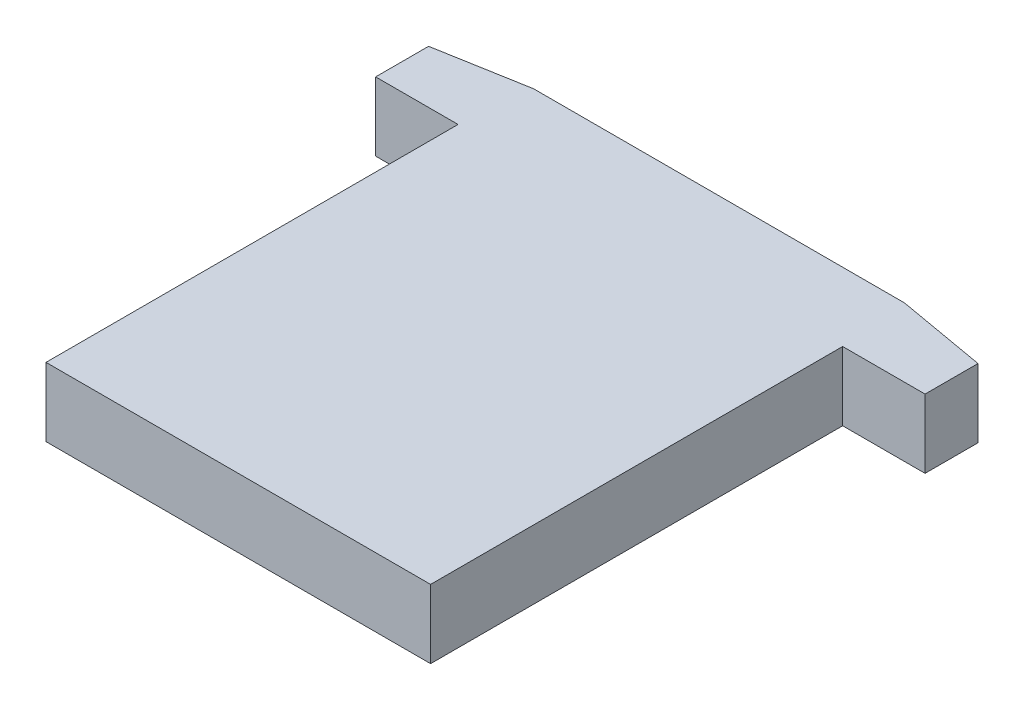
ISO-10303-21;
HEADER;
FILE_DESCRIPTION(('STEP AP214'),'2;1');
FILE_NAME('part.step','',(''),(''),'','','');
FILE_SCHEMA(('AUTOMOTIVE_DESIGN { 1 0 10303 214 1 1 1 1 }'));
ENDSEC;
DATA;
#1=APPLICATION_CONTEXT('core data for automotive mechanical design processes');
#2=APPLICATION_PROTOCOL_DEFINITION('international standard','automotive_design',2000,#1);
#3=PRODUCT_CONTEXT('',#1,'mechanical');
#4=PRODUCT('Part','Part','',(#3));
#5=PRODUCT_RELATED_PRODUCT_CATEGORY('part','',(#4));
#6=PRODUCT_DEFINITION_FORMATION('','',#4);
#7=PRODUCT_DEFINITION_CONTEXT('part definition',#1,'design');
#8=PRODUCT_DEFINITION('design','',#6,#7);
#9=PRODUCT_DEFINITION_SHAPE('','',#8);
#10=(LENGTH_UNIT() NAMED_UNIT(*) SI_UNIT(.MILLI.,.METRE.));
#11=(NAMED_UNIT(*) PLANE_ANGLE_UNIT() SI_UNIT($,.RADIAN.));
#12=(NAMED_UNIT(*) SI_UNIT($,.STERADIAN.) SOLID_ANGLE_UNIT());
#13=UNCERTAINTY_MEASURE_WITH_UNIT(LENGTH_MEASURE(1.E-05),#10,'distance_accuracy_value','');
#14=(GEOMETRIC_REPRESENTATION_CONTEXT(3) GLOBAL_UNCERTAINTY_ASSIGNED_CONTEXT((#13)) GLOBAL_UNIT_ASSIGNED_CONTEXT((#10,
#11,#12)) REPRESENTATION_CONTEXT('',''));
#15=CARTESIAN_POINT('',(0.,0.,0.));
#16=DIRECTION('',(0.,0.,1.));
#17=DIRECTION('',(1.,0.,0.));
#18=AXIS2_PLACEMENT_3D('',#15,#16,#17);
#19=CARTESIAN_POINT('',(0.,1.27,0.));
#20=DIRECTION('',(0.,1.,0.));
#21=DIRECTION('',(0.,0.,1.));
#22=AXIS2_PLACEMENT_3D('',#19,#20,#21);
#23=PLANE('',#22);
#24=DIRECTION('',(0.,0.,-1.));
#25=VECTOR('',#24,1.);
#26=CARTESIAN_POINT('',(3.556,1.27,7.62));
#27=LINE('',#26,#25);
#28=CARTESIAN_POINT('',(3.556,1.27,0.));
#29=VERTEX_POINT('',#28);
#30=CARTESIAN_POINT('',(3.556,1.27,7.62));
#31=VERTEX_POINT('',#30);
#32=EDGE_CURVE('E122',#29,#31,#27,.F.);
#33=ORIENTED_EDGE('',*,*,#32,.F.);
#34=DIRECTION('',(1.,0.,0.));
#35=VECTOR('',#34,1.);
#36=CARTESIAN_POINT('',(-5.08,1.27,0.));
#37=LINE('',#36,#35);
#38=CARTESIAN_POINT('',(5.08,1.27,0.));
#39=VERTEX_POINT('',#38);
#40=EDGE_CURVE('E126',#39,#29,#37,.F.);
#41=ORIENTED_EDGE('',*,*,#40,.F.);
#42=DIRECTION('',(0.,0.,-1.));
#43=VECTOR('',#42,1.);
#44=CARTESIAN_POINT('',(5.08,1.27,0.));
#45=LINE('',#44,#43);
#46=CARTESIAN_POINT('',(5.08,1.27,-0.97888415485033));
#47=VERTEX_POINT('',#46);
#48=EDGE_CURVE('E130',#47,#39,#45,.F.);
#49=ORIENTED_EDGE('',*,*,#48,.F.);
#50=DIRECTION('',(-0.984807753012213,0.,-0.173648177666902));
#51=VECTOR('',#50,1.);
#52=CARTESIAN_POINT('',(5.08,1.27,-0.97888415485033));
#53=LINE('',#52,#51);
#54=CARTESIAN_POINT('',(3.429,1.27,-1.26999999999999));
#55=VERTEX_POINT('',#54);
#56=EDGE_CURVE('E134',#55,#47,#53,.F.);
#57=ORIENTED_EDGE('',*,*,#56,.F.);
#58=DIRECTION('',(-1.,0.,0.));
#59=VECTOR('',#58,1.);
#60=CARTESIAN_POINT('',(3.429,1.27,-1.27));
#61=LINE('',#60,#59);
#62=CARTESIAN_POINT('',(-3.42899999999999,1.27,-1.27));
#63=VERTEX_POINT('',#62);
#64=EDGE_CURVE('E100',#63,#55,#61,.F.);
#65=ORIENTED_EDGE('',*,*,#64,.F.);
#66=DIRECTION('',(-0.984807753012209,0.,0.173648177666927));
#67=VECTOR('',#66,1.);
#68=CARTESIAN_POINT('',(-3.429,1.27,-1.27));
#69=LINE('',#68,#67);
#70=CARTESIAN_POINT('',(-5.08,1.27,-0.97888415485034));
#71=VERTEX_POINT('',#70);
#72=EDGE_CURVE('E20',#63,#71,#69,.T.);
#73=ORIENTED_EDGE('',*,*,#72,.T.);
#74=DIRECTION('',(0.,0.,1.));
#75=VECTOR('',#74,1.);
#76=CARTESIAN_POINT('',(-5.08,1.27,0.));
#77=LINE('',#76,#75);
#78=CARTESIAN_POINT('',(-5.08,1.27,0.));
#79=VERTEX_POINT('',#78);
#80=EDGE_CURVE('E97',#71,#79,#77,.T.);
#81=ORIENTED_EDGE('',*,*,#80,.T.);
#82=DIRECTION('',(1.,0.,0.));
#83=VECTOR('',#82,1.);
#84=CARTESIAN_POINT('',(-5.08,1.27,0.));
#85=LINE('',#84,#83);
#86=CARTESIAN_POINT('',(-3.556,1.27,0.));
#87=VERTEX_POINT('',#86);
#88=EDGE_CURVE('E112',#87,#79,#85,.F.);
#89=ORIENTED_EDGE('',*,*,#88,.F.);
#90=DIRECTION('',(0.,0.,1.));
#91=VECTOR('',#90,1.);
#92=CARTESIAN_POINT('',(-3.556,1.27,0.));
#93=LINE('',#92,#91);
#94=CARTESIAN_POINT('',(-3.556,1.27,7.62));
#95=VERTEX_POINT('',#94);
#96=EDGE_CURVE('E91',#95,#87,#93,.F.);
#97=ORIENTED_EDGE('',*,*,#96,.F.);
#98=DIRECTION('',(1.,0.,0.));
#99=VECTOR('',#98,1.);
#100=CARTESIAN_POINT('',(-3.556,1.27,7.62));
#101=LINE('',#100,#99);
#102=EDGE_CURVE('E118',#31,#95,#101,.F.);
#103=ORIENTED_EDGE('',*,*,#102,.F.);
#104=EDGE_LOOP('',(#33,#41,#49,#57,#65,#73,#81,#89,#97,#103));
#105=FACE_BOUND('',#104,.T.);
#106=ADVANCED_FACE('F17',(#105),#23,.T.);
#107=CARTESIAN_POINT('',(-5.08,0.,0.));
#108=DIRECTION('',(0.,0.,1.));
#109=DIRECTION('',(1.,0.,0.));
#110=AXIS2_PLACEMENT_3D('',#107,#108,#109);
#111=PLANE('',#110);
#112=DIRECTION('',(1.,0.,0.));
#113=VECTOR('',#112,1.);
#114=CARTESIAN_POINT('',(0.,0.,0.));
#115=LINE('',#114,#113);
#116=CARTESIAN_POINT('',(-5.08,0.,0.));
#117=VERTEX_POINT('',#116);
#118=CARTESIAN_POINT('',(-3.556,0.,0.));
#119=VERTEX_POINT('',#118);
#120=EDGE_CURVE('E106',#117,#119,#115,.T.);
#121=ORIENTED_EDGE('',*,*,#120,.T.);
#122=DIRECTION('',(0.,1.,0.));
#123=VECTOR('',#122,1.);
#124=CARTESIAN_POINT('',(-3.556,0.,0.));
#125=LINE('',#124,#123);
#126=EDGE_CURVE('E116',#87,#119,#125,.F.);
#127=ORIENTED_EDGE('',*,*,#126,.F.);
#128=ORIENTED_EDGE('',*,*,#88,.T.);
#129=DIRECTION('',(0.,1.,0.));
#130=VECTOR('',#129,1.);
#131=CARTESIAN_POINT('',(-5.08,0.,0.));
#132=LINE('',#131,#130);
#133=EDGE_CURVE('E107',#117,#79,#132,.T.);
#134=ORIENTED_EDGE('',*,*,#133,.F.);
#135=EDGE_LOOP('',(#121,#127,#128,#134));
#136=FACE_BOUND('',#135,.T.);
#137=ADVANCED_FACE('F199',(#136),#111,.T.);
#138=CARTESIAN_POINT('',(-3.556,0.,0.));
#139=DIRECTION('',(-1.,0.,0.));
#140=DIRECTION('',(0.,0.,1.));
#141=AXIS2_PLACEMENT_3D('',#138,#139,#140);
#142=PLANE('',#141);
#143=ORIENTED_EDGE('',*,*,#96,.T.);
#144=ORIENTED_EDGE('',*,*,#126,.T.);
#145=DIRECTION('',(0.,0.,1.));
#146=VECTOR('',#145,1.);
#147=CARTESIAN_POINT('',(-3.556,0.,0.));
#148=LINE('',#147,#146);
#149=CARTESIAN_POINT('',(-3.556,0.,7.62));
#150=VERTEX_POINT('',#149);
#151=EDGE_CURVE('E146',#119,#150,#148,.T.);
#152=ORIENTED_EDGE('',*,*,#151,.T.);
#153=DIRECTION('',(0.,1.,0.));
#154=VECTOR('',#153,1.);
#155=CARTESIAN_POINT('',(-3.556,0.,7.62));
#156=LINE('',#155,#154);
#157=EDGE_CURVE('E120',#95,#150,#156,.F.);
#158=ORIENTED_EDGE('',*,*,#157,.F.);
#159=EDGE_LOOP('',(#143,#144,#152,#158));
#160=FACE_BOUND('',#159,.T.);
#161=ADVANCED_FACE('F196',(#160),#142,.T.);
#162=CARTESIAN_POINT('',(-3.556,0.,7.62));
#163=DIRECTION('',(0.,0.,1.));
#164=DIRECTION('',(1.,0.,0.));
#165=AXIS2_PLACEMENT_3D('',#162,#163,#164);
#166=PLANE('',#165);
#167=ORIENTED_EDGE('',*,*,#157,.T.);
#168=DIRECTION('',(1.,0.,0.));
#169=VECTOR('',#168,1.);
#170=CARTESIAN_POINT('',(0.,0.,7.62));
#171=LINE('',#170,#169);
#172=CARTESIAN_POINT('',(3.556,0.,7.62));
#173=VERTEX_POINT('',#172);
#174=EDGE_CURVE('E149',#150,#173,#171,.T.);
#175=ORIENTED_EDGE('',*,*,#174,.T.);
#176=DIRECTION('',(0.,1.,0.));
#177=VECTOR('',#176,1.);
#178=CARTESIAN_POINT('',(3.556,0.,7.62));
#179=LINE('',#178,#177);
#180=EDGE_CURVE('E124',#31,#173,#179,.F.);
#181=ORIENTED_EDGE('',*,*,#180,.F.);
#182=ORIENTED_EDGE('',*,*,#102,.T.);
#183=EDGE_LOOP('',(#167,#175,#181,#182));
#184=FACE_BOUND('',#183,.T.);
#185=ADVANCED_FACE('F195',(#184),#166,.T.);
#186=CARTESIAN_POINT('',(3.556,0.,7.62));
#187=DIRECTION('',(1.,0.,0.));
#188=DIRECTION('',(0.,0.,-1.));
#189=AXIS2_PLACEMENT_3D('',#186,#187,#188);
#190=PLANE('',#189);
#191=DIRECTION('',(0.,0.,1.));
#192=VECTOR('',#191,1.);
#193=CARTESIAN_POINT('',(3.556,0.,0.));
#194=LINE('',#193,#192);
#195=CARTESIAN_POINT('',(3.556,0.,0.));
#196=VERTEX_POINT('',#195);
#197=EDGE_CURVE('E152',#173,#196,#194,.F.);
#198=ORIENTED_EDGE('',*,*,#197,.T.);
#199=DIRECTION('',(0.,1.,0.));
#200=VECTOR('',#199,1.);
#201=CARTESIAN_POINT('',(3.556,0.,0.));
#202=LINE('',#201,#200);
#203=EDGE_CURVE('E128',#29,#196,#202,.F.);
#204=ORIENTED_EDGE('',*,*,#203,.F.);
#205=ORIENTED_EDGE('',*,*,#32,.T.);
#206=ORIENTED_EDGE('',*,*,#180,.T.);
#207=EDGE_LOOP('',(#198,#204,#205,#206));
#208=FACE_BOUND('',#207,.T.);
#209=ADVANCED_FACE('F189',(#208),#190,.T.);
#210=CARTESIAN_POINT('',(-5.08,0.,0.));
#211=DIRECTION('',(0.,0.,1.));
#212=DIRECTION('',(1.,0.,0.));
#213=AXIS2_PLACEMENT_3D('',#210,#211,#212);
#214=PLANE('',#213);
#215=ORIENTED_EDGE('',*,*,#40,.T.);
#216=ORIENTED_EDGE('',*,*,#203,.T.);
#217=DIRECTION('',(1.,0.,0.));
#218=VECTOR('',#217,1.);
#219=CARTESIAN_POINT('',(0.,0.,0.));
#220=LINE('',#219,#218);
#221=CARTESIAN_POINT('',(5.08,0.,0.));
#222=VERTEX_POINT('',#221);
#223=EDGE_CURVE('E155',#196,#222,#220,.T.);
#224=ORIENTED_EDGE('',*,*,#223,.T.);
#225=DIRECTION('',(0.,1.,0.));
#226=VECTOR('',#225,1.);
#227=CARTESIAN_POINT('',(5.08,0.,0.));
#228=LINE('',#227,#226);
#229=EDGE_CURVE('E132',#39,#222,#228,.F.);
#230=ORIENTED_EDGE('',*,*,#229,.F.);
#231=EDGE_LOOP('',(#215,#216,#224,#230));
#232=FACE_BOUND('',#231,.T.);
#233=ADVANCED_FACE('F186',(#232),#214,.T.);
#234=CARTESIAN_POINT('',(5.08,0.,0.));
#235=DIRECTION('',(1.,0.,0.));
#236=DIRECTION('',(0.,0.,-1.));
#237=AXIS2_PLACEMENT_3D('',#234,#235,#236);
#238=PLANE('',#237);
#239=ORIENTED_EDGE('',*,*,#229,.T.);
#240=DIRECTION('',(0.,0.,1.));
#241=VECTOR('',#240,1.);
#242=CARTESIAN_POINT('',(5.08,0.,0.));
#243=LINE('',#242,#241);
#244=CARTESIAN_POINT('',(5.08,0.,-0.97888415485033));
#245=VERTEX_POINT('',#244);
#246=EDGE_CURVE('E158',#222,#245,#243,.F.);
#247=ORIENTED_EDGE('',*,*,#246,.T.);
#248=DIRECTION('',(0.,1.,0.));
#249=VECTOR('',#248,1.);
#250=CARTESIAN_POINT('',(5.08,0.,-0.97888415485033));
#251=LINE('',#250,#249);
#252=EDGE_CURVE('E136',#47,#245,#251,.F.);
#253=ORIENTED_EDGE('',*,*,#252,.F.);
#254=ORIENTED_EDGE('',*,*,#48,.T.);
#255=EDGE_LOOP('',(#239,#247,#253,#254));
#256=FACE_BOUND('',#255,.T.);
#257=ADVANCED_FACE('F180',(#256),#238,.T.);
#258=CARTESIAN_POINT('',(5.08,0.,-0.97888415485033));
#259=DIRECTION('',(0.173648177666902,0.,-0.984807753012213));
#260=DIRECTION('',(-0.984807753012213,0.,-0.173648177666902));
#261=AXIS2_PLACEMENT_3D('',#258,#259,#260);
#262=PLANE('',#261);
#263=ORIENTED_EDGE('',*,*,#252,.T.);
#264=DIRECTION('',(-0.984807753012209,0.,-0.173648177666927));
#265=VECTOR('',#264,1.);
#266=CARTESIAN_POINT('',(5.08,0.,-0.97888415485033));
#267=LINE('',#266,#265);
#268=CARTESIAN_POINT('',(3.429,0.,-1.26999999999998));
#269=VERTEX_POINT('',#268);
#270=EDGE_CURVE('E161',#245,#269,#267,.T.);
#271=ORIENTED_EDGE('',*,*,#270,.T.);
#272=DIRECTION('',(0.,1.,0.));
#273=VECTOR('',#272,1.);
#274=CARTESIAN_POINT('',(3.429,0.,-1.27));
#275=LINE('',#274,#273);
#276=EDGE_CURVE('E139',#55,#269,#275,.F.);
#277=ORIENTED_EDGE('',*,*,#276,.F.);
#278=ORIENTED_EDGE('',*,*,#56,.T.);
#279=EDGE_LOOP('',(#263,#271,#277,#278));
#280=FACE_BOUND('',#279,.T.);
#281=ADVANCED_FACE('F176',(#280),#262,.T.);
#282=CARTESIAN_POINT('',(3.429,0.,-1.27));
#283=DIRECTION('',(0.,0.,-1.));
#284=DIRECTION('',(-1.,0.,0.));
#285=AXIS2_PLACEMENT_3D('',#282,#283,#284);
#286=PLANE('',#285);
#287=ORIENTED_EDGE('',*,*,#276,.T.);
#288=DIRECTION('',(1.,0.,0.));
#289=VECTOR('',#288,1.);
#290=CARTESIAN_POINT('',(0.,0.,-1.27));
#291=LINE('',#290,#289);
#292=CARTESIAN_POINT('',(-3.429,0.,-1.27));
#293=VERTEX_POINT('',#292);
#294=EDGE_CURVE('E164',#269,#293,#291,.F.);
#295=ORIENTED_EDGE('',*,*,#294,.T.);
#296=DIRECTION('',(0.,1.,0.));
#297=VECTOR('',#296,1.);
#298=CARTESIAN_POINT('',(-3.429,0.,-1.27));
#299=LINE('',#298,#297);
#300=EDGE_CURVE('E141',#63,#293,#299,.F.);
#301=ORIENTED_EDGE('',*,*,#300,.F.);
#302=ORIENTED_EDGE('',*,*,#64,.T.);
#303=EDGE_LOOP('',(#287,#295,#301,#302));
#304=FACE_BOUND('',#303,.T.);
#305=ADVANCED_FACE('F169',(#304),#286,.T.);
#306=CARTESIAN_POINT('',(-3.429,0.,-1.27));
#307=DIRECTION('',(-0.173648177666902,0.,-0.984807753012213));
#308=DIRECTION('',(-0.984807753012213,0.,0.173648177666902));
#309=AXIS2_PLACEMENT_3D('',#306,#307,#308);
#310=PLANE('',#309);
#311=ORIENTED_EDGE('',*,*,#300,.T.);
#312=DIRECTION('',(-0.984807753012209,0.,0.173648177666927));
#313=VECTOR('',#312,1.);
#314=CARTESIAN_POINT('',(-3.429,0.,-1.27));
#315=LINE('',#314,#313);
#316=CARTESIAN_POINT('',(-5.08,0.,-0.978884154850351));
#317=VERTEX_POINT('',#316);
#318=EDGE_CURVE('E26',#293,#317,#315,.T.);
#319=ORIENTED_EDGE('',*,*,#318,.T.);
#320=DIRECTION('',(0.,1.,0.));
#321=VECTOR('',#320,1.);
#322=CARTESIAN_POINT('',(-5.08,0.,-0.97888415485033));
#323=LINE('',#322,#321);
#324=EDGE_CURVE('E34',#71,#317,#323,.F.);
#325=ORIENTED_EDGE('',*,*,#324,.F.);
#326=ORIENTED_EDGE('',*,*,#72,.F.);
#327=EDGE_LOOP('',(#311,#319,#325,#326));
#328=FACE_BOUND('',#327,.T.);
#329=ADVANCED_FACE('F104',(#328),#310,.T.);
#330=CARTESIAN_POINT('',(-5.08,0.,-0.97888415485033));
#331=DIRECTION('',(-1.,0.,0.));
#332=DIRECTION('',(0.,0.,1.));
#333=AXIS2_PLACEMENT_3D('',#330,#331,#332);
#334=PLANE('',#333);
#335=ORIENTED_EDGE('',*,*,#324,.T.);
#336=DIRECTION('',(0.,0.,1.));
#337=VECTOR('',#336,1.);
#338=CARTESIAN_POINT('',(-5.08,0.,0.));
#339=LINE('',#338,#337);
#340=EDGE_CURVE('E11',#317,#117,#339,.T.);
#341=ORIENTED_EDGE('',*,*,#340,.T.);
#342=ORIENTED_EDGE('',*,*,#133,.T.);
#343=ORIENTED_EDGE('',*,*,#80,.F.);
#344=EDGE_LOOP('',(#335,#341,#342,#343));
#345=FACE_BOUND('',#344,.T.);
#346=ADVANCED_FACE('F110',(#345),#334,.T.);
#347=CARTESIAN_POINT('',(0.,0.,0.));
#348=DIRECTION('',(0.,1.,0.));
#349=DIRECTION('',(0.,0.,1.));
#350=AXIS2_PLACEMENT_3D('',#347,#348,#349);
#351=PLANE('',#350);
#352=ORIENTED_EDGE('',*,*,#318,.F.);
#353=ORIENTED_EDGE('',*,*,#294,.F.);
#354=ORIENTED_EDGE('',*,*,#270,.F.);
#355=ORIENTED_EDGE('',*,*,#246,.F.);
#356=ORIENTED_EDGE('',*,*,#223,.F.);
#357=ORIENTED_EDGE('',*,*,#197,.F.);
#358=ORIENTED_EDGE('',*,*,#174,.F.);
#359=ORIENTED_EDGE('',*,*,#151,.F.);
#360=ORIENTED_EDGE('',*,*,#120,.F.);
#361=ORIENTED_EDGE('',*,*,#340,.F.);
#362=EDGE_LOOP('',(#352,#353,#354,#355,#356,#357,#358,#359,#360,#361));
#363=FACE_BOUND('',#362,.T.);
#364=ADVANCED_FACE('F173',(#363),#351,.F.);
#365=CLOSED_SHELL('',(#106,#137,#161,#185,#209,#233,#257,#281,#305,#329,#346,#364));
#366=MANIFOLD_SOLID_BREP('B1',#365);
#367=ADVANCED_BREP_SHAPE_REPRESENTATION('',(#18,#366),#14);
#368=SHAPE_DEFINITION_REPRESENTATION(#9,#367);
ENDSEC;
END-ISO-10303-21;
